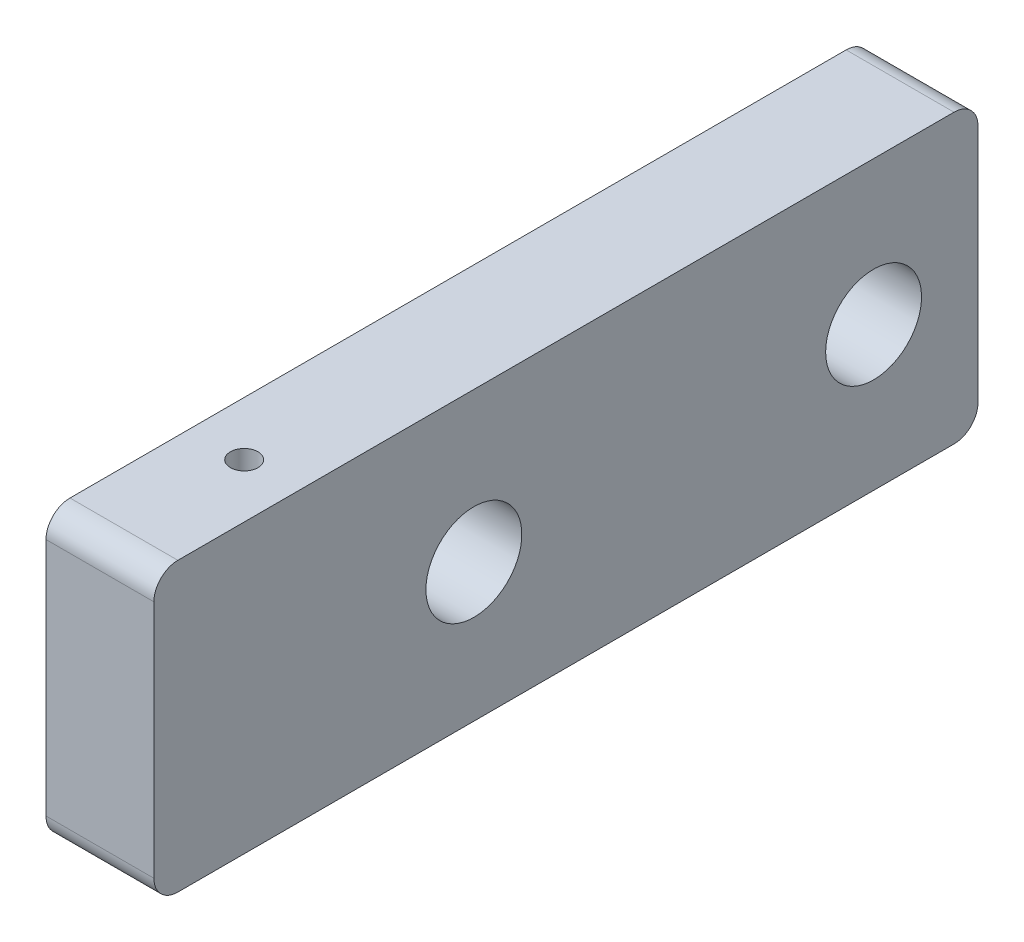
ISO-10303-21;
HEADER;
FILE_DESCRIPTION(('STEP AP214'),'2;1');
FILE_NAME('part.step','',(''),(''),'','','');
FILE_SCHEMA(('AUTOMOTIVE_DESIGN { 1 0 10303 214 1 1 1 1 }'));
ENDSEC;
DATA;
#1=APPLICATION_CONTEXT('core data for automotive mechanical design processes');
#2=APPLICATION_PROTOCOL_DEFINITION('international standard','automotive_design',2000,#1);
#3=PRODUCT_CONTEXT('',#1,'mechanical');
#4=PRODUCT('Part','Part','',(#3));
#5=PRODUCT_RELATED_PRODUCT_CATEGORY('part','',(#4));
#6=PRODUCT_DEFINITION_FORMATION('','',#4);
#7=PRODUCT_DEFINITION_CONTEXT('part definition',#1,'design');
#8=PRODUCT_DEFINITION('design','',#6,#7);
#9=PRODUCT_DEFINITION_SHAPE('','',#8);
#10=(LENGTH_UNIT() NAMED_UNIT(*) SI_UNIT(.MILLI.,.METRE.));
#11=(NAMED_UNIT(*) PLANE_ANGLE_UNIT() SI_UNIT($,.RADIAN.));
#12=(NAMED_UNIT(*) SI_UNIT($,.STERADIAN.) SOLID_ANGLE_UNIT());
#13=UNCERTAINTY_MEASURE_WITH_UNIT(LENGTH_MEASURE(1.E-05),#10,'distance_accuracy_value','');
#14=(GEOMETRIC_REPRESENTATION_CONTEXT(3) GLOBAL_UNCERTAINTY_ASSIGNED_CONTEXT((#13)) GLOBAL_UNIT_ASSIGNED_CONTEXT((#10,
#11,#12)) REPRESENTATION_CONTEXT('',''));
#15=CARTESIAN_POINT('',(0.,0.,0.));
#16=DIRECTION('',(0.,0.,1.));
#17=DIRECTION('',(1.,0.,0.));
#18=AXIS2_PLACEMENT_3D('',#15,#16,#17);
#19=CARTESIAN_POINT('',(65.9692086330936,-4.19999999999998,-14.0547659320805));
#20=DIRECTION('',(0.,0.,1.));
#21=DIRECTION('',(1.,0.,0.));
#22=AXIS2_PLACEMENT_3D('',#19,#20,#21);
#23=PLANE('',#22);
#24=DIRECTION('',(0.,-1.,0.));
#25=VECTOR('',#24,1.);
#26=CARTESIAN_POINT('',(74.9692086330936,-4.19999999999998,-14.0547659320805));
#27=LINE('',#26,#25);
#28=CARTESIAN_POINT('',(74.9692086330936,17.7712409049116,-14.0547659320805));
#29=VERTEX_POINT('',#28);
#30=CARTESIAN_POINT('',(74.9692086330936,-2.19999999999998,-14.0547659320805));
#31=VERTEX_POINT('',#30);
#32=EDGE_CURVE('E138',#29,#31,#27,.T.);
#33=ORIENTED_EDGE('',*,*,#32,.T.);
#34=DIRECTION('',(1.,0.,0.));
#35=VECTOR('',#34,1.);
#36=CARTESIAN_POINT('',(65.9692086330936,-2.19999999999998,-14.0547659320805));
#37=LINE('',#36,#35);
#38=CARTESIAN_POINT('',(65.9692086330936,-2.19999999999998,-14.0547659320805));
#39=VERTEX_POINT('',#38);
#40=EDGE_CURVE('E115',#31,#39,#37,.F.);
#41=ORIENTED_EDGE('',*,*,#40,.T.);
#42=DIRECTION('',(0.,-1.,0.));
#43=VECTOR('',#42,1.);
#44=CARTESIAN_POINT('',(65.9692086330936,-4.19999999999998,-14.0547659320805));
#45=LINE('',#44,#43);
#46=CARTESIAN_POINT('',(65.9692086330936,17.7712409049116,-14.0547659320805));
#47=VERTEX_POINT('',#46);
#48=EDGE_CURVE('E148',#47,#39,#45,.T.);
#49=ORIENTED_EDGE('',*,*,#48,.F.);
#50=DIRECTION('',(1.,0.,0.));
#51=VECTOR('',#50,1.);
#52=CARTESIAN_POINT('',(65.9692086330936,17.7712409049116,-14.0547659320805));
#53=LINE('',#52,#51);
#54=EDGE_CURVE('E120',#47,#29,#53,.T.);
#55=ORIENTED_EDGE('',*,*,#54,.T.);
#56=EDGE_LOOP('',(#33,#41,#49,#55));
#57=FACE_BOUND('',#56,.T.);
#58=ADVANCED_FACE('F44',(#57),#23,.F.);
#59=CARTESIAN_POINT('',(65.9692086330936,-4.19999999999998,54.6932024419858));
#60=DIRECTION('',(0.,1.,0.));
#61=DIRECTION('',(0.,0.,1.));
#62=AXIS2_PLACEMENT_3D('',#59,#60,#61);
#63=PLANE('',#62);
#64=DIRECTION('',(0.,0.,1.));
#65=VECTOR('',#64,1.);
#66=CARTESIAN_POINT('',(65.9692086330936,-4.19999999999998,54.6932024419858));
#67=LINE('',#66,#65);
#68=CARTESIAN_POINT('',(65.9692086330936,-4.19999999999998,-12.0547659320805));
#69=VERTEX_POINT('',#68);
#70=CARTESIAN_POINT('',(65.9692086330936,-4.19999999999998,52.6932024419858));
#71=VERTEX_POINT('',#70);
#72=EDGE_CURVE('E130',#69,#71,#67,.T.);
#73=ORIENTED_EDGE('',*,*,#72,.F.);
#74=DIRECTION('',(1.,0.,0.));
#75=VECTOR('',#74,1.);
#76=CARTESIAN_POINT('',(65.9692086330936,-4.19999999999998,-12.0547659320805));
#77=LINE('',#76,#75);
#78=CARTESIAN_POINT('',(74.9692086330936,-4.19999999999998,-12.0547659320805));
#79=VERTEX_POINT('',#78);
#80=EDGE_CURVE('E114',#69,#79,#77,.T.);
#81=ORIENTED_EDGE('',*,*,#80,.T.);
#82=DIRECTION('',(0.,0.,1.));
#83=VECTOR('',#82,1.);
#84=CARTESIAN_POINT('',(74.9692086330936,-4.19999999999998,54.6932024419858));
#85=LINE('',#84,#83);
#86=CARTESIAN_POINT('',(74.9692086330936,-4.19999999999998,52.6932024419858));
#87=VERTEX_POINT('',#86);
#88=EDGE_CURVE('E127',#79,#87,#85,.T.);
#89=ORIENTED_EDGE('',*,*,#88,.T.);
#90=DIRECTION('',(1.,0.,0.));
#91=VECTOR('',#90,1.);
#92=CARTESIAN_POINT('',(65.9692086330936,-4.19999999999998,52.6932024419858));
#93=LINE('',#92,#91);
#94=EDGE_CURVE('E132',#87,#71,#93,.F.);
#95=ORIENTED_EDGE('',*,*,#94,.T.);
#96=EDGE_LOOP('',(#73,#81,#89,#95));
#97=FACE_BOUND('',#96,.T.);
#98=ADVANCED_FACE('F126',(#97),#63,.F.);
#99=CARTESIAN_POINT('',(65.9692086330936,19.7712409049116,54.6932024419858));
#100=DIRECTION('',(0.,0.,-1.));
#101=DIRECTION('',(-1.,0.,0.));
#102=AXIS2_PLACEMENT_3D('',#99,#100,#101);
#103=PLANE('',#102);
#104=DIRECTION('',(0.,1.,0.));
#105=VECTOR('',#104,1.);
#106=CARTESIAN_POINT('',(74.9692086330936,19.7712409049116,54.6932024419858));
#107=LINE('',#106,#105);
#108=CARTESIAN_POINT('',(74.9692086330936,-2.19999999999998,54.6932024419858));
#109=VERTEX_POINT('',#108);
#110=CARTESIAN_POINT('',(74.9692086330936,17.7712409049116,54.6932024419858));
#111=VERTEX_POINT('',#110);
#112=EDGE_CURVE('E137',#109,#111,#107,.T.);
#113=ORIENTED_EDGE('',*,*,#112,.T.);
#114=DIRECTION('',(1.,0.,0.));
#115=VECTOR('',#114,1.);
#116=CARTESIAN_POINT('',(65.9692086330936,17.7712409049116,54.6932024419858));
#117=LINE('',#116,#115);
#118=CARTESIAN_POINT('',(65.9692086330936,17.7712409049116,54.6932024419858));
#119=VERTEX_POINT('',#118);
#120=EDGE_CURVE('E13',#111,#119,#117,.F.);
#121=ORIENTED_EDGE('',*,*,#120,.T.);
#122=DIRECTION('',(0.,1.,0.));
#123=VECTOR('',#122,1.);
#124=CARTESIAN_POINT('',(65.9692086330936,19.7712409049116,54.6932024419858));
#125=LINE('',#124,#123);
#126=CARTESIAN_POINT('',(65.9692086330936,-2.19999999999998,54.6932024419858));
#127=VERTEX_POINT('',#126);
#128=EDGE_CURVE('E173',#127,#119,#125,.T.);
#129=ORIENTED_EDGE('',*,*,#128,.F.);
#130=DIRECTION('',(1.,0.,0.));
#131=VECTOR('',#130,1.);
#132=CARTESIAN_POINT('',(65.9692086330936,-2.19999999999998,54.6932024419858));
#133=LINE('',#132,#131);
#134=EDGE_CURVE('E52',#127,#109,#133,.T.);
#135=ORIENTED_EDGE('',*,*,#134,.T.);
#136=EDGE_LOOP('',(#113,#121,#129,#135));
#137=FACE_BOUND('',#136,.T.);
#138=ADVANCED_FACE('F171',(#137),#103,.F.);
#139=CARTESIAN_POINT('',(65.9692086330936,19.7712409049116,54.6932024419858));
#140=DIRECTION('',(0.,-1.,0.));
#141=DIRECTION('',(0.,0.,-1.));
#142=AXIS2_PLACEMENT_3D('',#139,#140,#141);
#143=PLANE('',#142);
#144=CARTESIAN_POINT('',(70.4692086330936,19.7712409049116,42.6592779916703));
#145=DIRECTION('',(0.,1.,0.));
#146=DIRECTION('',(0.,0.,1.));
#147=AXIS2_PLACEMENT_3D('',#144,#145,#146);
#148=CIRCLE('',#147,1.15);
#149=CARTESIAN_POINT('',(70.4692086330936,19.7712409049116,43.8092779916703));
#150=VERTEX_POINT('',#149);
#151=EDGE_CURVE('E193',#150,#150,#148,.T.);
#152=ORIENTED_EDGE('',*,*,#151,.F.);
#153=EDGE_LOOP('',(#152));
#154=FACE_BOUND('',#153,.T.);
#155=DIRECTION('',(0.,0.,-1.));
#156=VECTOR('',#155,1.);
#157=CARTESIAN_POINT('',(65.9692086330936,19.7712409049116,54.6932024419858));
#158=LINE('',#157,#156);
#159=CARTESIAN_POINT('',(65.9692086330936,19.7712409049116,52.6932024419858));
#160=VERTEX_POINT('',#159);
#161=CARTESIAN_POINT('',(65.9692086330936,19.7712409049116,-12.0547659320805));
#162=VERTEX_POINT('',#161);
#163=EDGE_CURVE('E149',#160,#162,#158,.T.);
#164=ORIENTED_EDGE('',*,*,#163,.F.);
#165=DIRECTION('',(1.,0.,0.));
#166=VECTOR('',#165,1.);
#167=CARTESIAN_POINT('',(65.9692086330936,19.7712409049116,52.6932024419858));
#168=LINE('',#167,#166);
#169=CARTESIAN_POINT('',(74.9692086330936,19.7712409049116,52.6932024419858));
#170=VERTEX_POINT('',#169);
#171=EDGE_CURVE('E165',#160,#170,#168,.T.);
#172=ORIENTED_EDGE('',*,*,#171,.T.);
#173=DIRECTION('',(0.,0.,-1.));
#174=VECTOR('',#173,1.);
#175=CARTESIAN_POINT('',(74.9692086330936,19.7712409049116,54.6932024419858));
#176=LINE('',#175,#174);
#177=CARTESIAN_POINT('',(74.9692086330936,19.7712409049116,-12.0547659320805));
#178=VERTEX_POINT('',#177);
#179=EDGE_CURVE('E141',#170,#178,#176,.T.);
#180=ORIENTED_EDGE('',*,*,#179,.T.);
#181=DIRECTION('',(1.,0.,0.));
#182=VECTOR('',#181,1.);
#183=CARTESIAN_POINT('',(65.9692086330936,19.7712409049116,-12.0547659320805));
#184=LINE('',#183,#182);
#185=EDGE_CURVE('E59',#178,#162,#184,.F.);
#186=ORIENTED_EDGE('',*,*,#185,.T.);
#187=EDGE_LOOP('',(#164,#172,#180,#186));
#188=FACE_BOUND('',#187,.T.);
#189=ADVANCED_FACE('F180',(#154,#188),#143,.F.);
#190=CARTESIAN_POINT('',(65.9692086330936,0.,0.));
#191=DIRECTION('',(-1.,0.,0.));
#192=DIRECTION('',(0.,0.,1.));
#193=AXIS2_PLACEMENT_3D('',#190,#191,#192);
#194=PLANE('',#193);
#195=CARTESIAN_POINT('',(65.9692086330936,7.78562045245583,-5.34476642061127));
#196=DIRECTION('',(-1.,0.,0.));
#197=DIRECTION('',(0.,0.,1.));
#198=AXIS2_PLACEMENT_3D('',#195,#196,#197);
#199=CIRCLE('',#198,4.);
#200=CARTESIAN_POINT('',(65.9692086330936,7.78562045245583,-1.34476642061127));
#201=VERTEX_POINT('',#200);
#202=EDGE_CURVE('E201',#201,#201,#199,.T.);
#203=ORIENTED_EDGE('',*,*,#202,.F.);
#204=EDGE_LOOP('',(#203));
#205=FACE_BOUND('',#204,.T.);
#206=CARTESIAN_POINT('',(65.9692086330936,7.30000000000002,28.));
#207=DIRECTION('',(-1.,0.,0.));
#208=DIRECTION('',(0.,0.,1.));
#209=AXIS2_PLACEMENT_3D('',#206,#207,#208);
#210=CIRCLE('',#209,4.);
#211=CARTESIAN_POINT('',(65.9692086330936,7.30000000000002,32.));
#212=VERTEX_POINT('',#211);
#213=EDGE_CURVE('E187',#212,#212,#210,.T.);
#214=ORIENTED_EDGE('',*,*,#213,.F.);
#215=EDGE_LOOP('',(#214));
#216=FACE_BOUND('',#215,.T.);
#217=ORIENTED_EDGE('',*,*,#48,.T.);
#218=CARTESIAN_POINT('',(65.9692086330936,-2.19999999999998,-12.0547659320805));
#219=DIRECTION('',(-1.,0.,0.));
#220=DIRECTION('',(0.,0.,1.));
#221=AXIS2_PLACEMENT_3D('',#218,#219,#220);
#222=CIRCLE('',#221,2.);
#223=EDGE_CURVE('E162',#39,#69,#222,.T.);
#224=ORIENTED_EDGE('',*,*,#223,.T.);
#225=ORIENTED_EDGE('',*,*,#72,.T.);
#226=CARTESIAN_POINT('',(65.9692086330936,-2.19999999999998,52.6932024419858));
#227=DIRECTION('',(-1.,0.,0.));
#228=DIRECTION('',(0.,0.,1.));
#229=AXIS2_PLACEMENT_3D('',#226,#227,#228);
#230=CIRCLE('',#229,2.);
#231=EDGE_CURVE('E159',#71,#127,#230,.T.);
#232=ORIENTED_EDGE('',*,*,#231,.T.);
#233=ORIENTED_EDGE('',*,*,#128,.T.);
#234=CARTESIAN_POINT('',(65.9692086330936,17.7712409049116,52.6932024419858));
#235=DIRECTION('',(-1.,0.,0.));
#236=DIRECTION('',(0.,0.,1.));
#237=AXIS2_PLACEMENT_3D('',#234,#235,#236);
#238=CIRCLE('',#237,2.);
#239=EDGE_CURVE('E66',#119,#160,#238,.T.);
#240=ORIENTED_EDGE('',*,*,#239,.T.);
#241=ORIENTED_EDGE('',*,*,#163,.T.);
#242=CARTESIAN_POINT('',(65.9692086330936,17.7712409049116,-12.0547659320805));
#243=DIRECTION('',(-1.,0.,0.));
#244=DIRECTION('',(0.,0.,1.));
#245=AXIS2_PLACEMENT_3D('',#242,#243,#244);
#246=CIRCLE('',#245,2.);
#247=EDGE_CURVE('E157',#162,#47,#246,.T.);
#248=ORIENTED_EDGE('',*,*,#247,.T.);
#249=EDGE_LOOP('',(#217,#224,#225,#232,#233,#240,#241,#248));
#250=FACE_BOUND('',#249,.T.);
#251=ADVANCED_FACE('F208',(#205,#216,#250),#194,.T.);
#252=CARTESIAN_POINT('',(74.9692086330936,0.,0.));
#253=DIRECTION('',(-1.,0.,0.));
#254=DIRECTION('',(0.,0.,1.));
#255=AXIS2_PLACEMENT_3D('',#252,#253,#254);
#256=PLANE('',#255);
#257=CARTESIAN_POINT('',(74.9692086330936,7.78562045245583,-5.34476642061127));
#258=DIRECTION('',(-1.,0.,0.));
#259=DIRECTION('',(0.,0.,1.));
#260=AXIS2_PLACEMENT_3D('',#257,#258,#259);
#261=CIRCLE('',#260,4.);
#262=CARTESIAN_POINT('',(74.9692086330936,7.78562045245583,-1.34476642061127));
#263=VERTEX_POINT('',#262);
#264=EDGE_CURVE('E196',#263,#263,#261,.F.);
#265=ORIENTED_EDGE('',*,*,#264,.F.);
#266=EDGE_LOOP('',(#265));
#267=FACE_BOUND('',#266,.T.);
#268=CARTESIAN_POINT('',(74.9692086330936,7.30000000000002,28.));
#269=DIRECTION('',(-1.,0.,0.));
#270=DIRECTION('',(0.,0.,1.));
#271=AXIS2_PLACEMENT_3D('',#268,#269,#270);
#272=CIRCLE('',#271,4.);
#273=CARTESIAN_POINT('',(74.9692086330936,7.30000000000002,32.));
#274=VERTEX_POINT('',#273);
#275=EDGE_CURVE('E143',#274,#274,#272,.T.);
#276=ORIENTED_EDGE('',*,*,#275,.T.);
#277=EDGE_LOOP('',(#276));
#278=FACE_BOUND('',#277,.T.);
#279=ORIENTED_EDGE('',*,*,#88,.F.);
#280=CARTESIAN_POINT('',(74.9692086330936,-2.19999999999998,-12.0547659320805));
#281=DIRECTION('',(-1.,0.,0.));
#282=DIRECTION('',(0.,0.,1.));
#283=AXIS2_PLACEMENT_3D('',#280,#281,#282);
#284=CIRCLE('',#283,2.);
#285=EDGE_CURVE('E110',#79,#31,#284,.F.);
#286=ORIENTED_EDGE('',*,*,#285,.T.);
#287=ORIENTED_EDGE('',*,*,#32,.F.);
#288=CARTESIAN_POINT('',(74.9692086330936,17.7712409049116,-12.0547659320805));
#289=DIRECTION('',(-1.,0.,0.));
#290=DIRECTION('',(0.,0.,1.));
#291=AXIS2_PLACEMENT_3D('',#288,#289,#290);
#292=CIRCLE('',#291,2.);
#293=EDGE_CURVE('E131',#29,#178,#292,.F.);
#294=ORIENTED_EDGE('',*,*,#293,.T.);
#295=ORIENTED_EDGE('',*,*,#179,.F.);
#296=CARTESIAN_POINT('',(74.9692086330936,17.7712409049116,52.6932024419858));
#297=DIRECTION('',(-1.,0.,0.));
#298=DIRECTION('',(0.,0.,1.));
#299=AXIS2_PLACEMENT_3D('',#296,#297,#298);
#300=CIRCLE('',#299,2.);
#301=EDGE_CURVE('E121',#170,#111,#300,.F.);
#302=ORIENTED_EDGE('',*,*,#301,.T.);
#303=ORIENTED_EDGE('',*,*,#112,.F.);
#304=CARTESIAN_POINT('',(74.9692086330936,-2.19999999999998,52.6932024419858));
#305=DIRECTION('',(-1.,0.,0.));
#306=DIRECTION('',(0.,0.,1.));
#307=AXIS2_PLACEMENT_3D('',#304,#305,#306);
#308=CIRCLE('',#307,2.);
#309=EDGE_CURVE('E136',#109,#87,#308,.F.);
#310=ORIENTED_EDGE('',*,*,#309,.T.);
#311=EDGE_LOOP('',(#279,#286,#287,#294,#295,#302,#303,#310));
#312=FACE_BOUND('',#311,.T.);
#313=ADVANCED_FACE('F134',(#267,#278,#312),#256,.F.);
#314=CARTESIAN_POINT('',(74.9692086330936,7.30000000000002,28.));
#315=DIRECTION('',(-1.,0.,0.));
#316=DIRECTION('',(0.,0.,1.));
#317=AXIS2_PLACEMENT_3D('',#314,#315,#316);
#318=CYLINDRICAL_SURFACE('',#317,4.);
#319=ORIENTED_EDGE('',*,*,#275,.F.);
#320=EDGE_LOOP('',(#319));
#321=FACE_BOUND('',#320,.T.);
#322=ORIENTED_EDGE('',*,*,#213,.T.);
#323=EDGE_LOOP('',(#322));
#324=FACE_BOUND('',#323,.T.);
#325=ADVANCED_FACE('F237',(#321,#324),#318,.F.);
#326=CARTESIAN_POINT('',(65.9692086330936,-2.19999999999998,-12.0547659320805));
#327=DIRECTION('',(1.,0.,0.));
#328=DIRECTION('',(0.,0.,-1.));
#329=AXIS2_PLACEMENT_3D('',#326,#327,#328);
#330=CYLINDRICAL_SURFACE('',#329,2.);
#331=ORIENTED_EDGE('',*,*,#223,.F.);
#332=ORIENTED_EDGE('',*,*,#40,.F.);
#333=ORIENTED_EDGE('',*,*,#285,.F.);
#334=ORIENTED_EDGE('',*,*,#80,.F.);
#335=EDGE_LOOP('',(#331,#332,#333,#334));
#336=FACE_BOUND('',#335,.T.);
#337=ADVANCED_FACE('F113',(#336),#330,.T.);
#338=CARTESIAN_POINT('',(65.9692086330936,17.7712409049116,52.6932024419858));
#339=DIRECTION('',(1.,0.,0.));
#340=DIRECTION('',(0.,0.,-1.));
#341=AXIS2_PLACEMENT_3D('',#338,#339,#340);
#342=CYLINDRICAL_SURFACE('',#341,2.);
#343=ORIENTED_EDGE('',*,*,#239,.F.);
#344=ORIENTED_EDGE('',*,*,#120,.F.);
#345=ORIENTED_EDGE('',*,*,#301,.F.);
#346=ORIENTED_EDGE('',*,*,#171,.F.);
#347=EDGE_LOOP('',(#343,#344,#345,#346));
#348=FACE_BOUND('',#347,.T.);
#349=ADVANCED_FACE('F179',(#348),#342,.T.);
#350=CARTESIAN_POINT('',(65.9692086330936,-2.19999999999998,52.6932024419858));
#351=DIRECTION('',(1.,0.,0.));
#352=DIRECTION('',(0.,0.,-1.));
#353=AXIS2_PLACEMENT_3D('',#350,#351,#352);
#354=CYLINDRICAL_SURFACE('',#353,2.);
#355=ORIENTED_EDGE('',*,*,#231,.F.);
#356=ORIENTED_EDGE('',*,*,#94,.F.);
#357=ORIENTED_EDGE('',*,*,#309,.F.);
#358=ORIENTED_EDGE('',*,*,#134,.F.);
#359=EDGE_LOOP('',(#355,#356,#357,#358));
#360=FACE_BOUND('',#359,.T.);
#361=ADVANCED_FACE('F219',(#360),#354,.T.);
#362=CARTESIAN_POINT('',(65.9692086330936,17.7712409049116,-12.0547659320805));
#363=DIRECTION('',(1.,0.,0.));
#364=DIRECTION('',(0.,0.,-1.));
#365=AXIS2_PLACEMENT_3D('',#362,#363,#364);
#366=CYLINDRICAL_SURFACE('',#365,2.);
#367=ORIENTED_EDGE('',*,*,#247,.F.);
#368=ORIENTED_EDGE('',*,*,#185,.F.);
#369=ORIENTED_EDGE('',*,*,#293,.F.);
#370=ORIENTED_EDGE('',*,*,#54,.F.);
#371=EDGE_LOOP('',(#367,#368,#369,#370));
#372=FACE_BOUND('',#371,.T.);
#373=ADVANCED_FACE('F46',(#372),#366,.T.);
#374=CARTESIAN_POINT('',(70.4692086330936,14.7712409049116,42.6592779916703));
#375=DIRECTION('',(0.,1.,0.));
#376=DIRECTION('',(0.,0.,1.));
#377=AXIS2_PLACEMENT_3D('',#374,#375,#376);
#378=CYLINDRICAL_SURFACE('',#377,1.15);
#379=CARTESIAN_POINT('',(70.4692086330936,14.7712409049116,42.6592779916703));
#380=DIRECTION('',(0.,1.,0.));
#381=DIRECTION('',(0.,0.,1.));
#382=AXIS2_PLACEMENT_3D('',#379,#380,#381);
#383=CIRCLE('',#382,1.15);
#384=CARTESIAN_POINT('',(70.4692086330936,14.7712409049116,43.8092779916703));
#385=VERTEX_POINT('',#384);
#386=EDGE_CURVE('E190',#385,#385,#383,.T.);
#387=ORIENTED_EDGE('',*,*,#386,.F.);
#388=EDGE_LOOP('',(#387));
#389=FACE_BOUND('',#388,.T.);
#390=ORIENTED_EDGE('',*,*,#151,.T.);
#391=EDGE_LOOP('',(#390));
#392=FACE_BOUND('',#391,.T.);
#393=ADVANCED_FACE('F218',(#389,#392),#378,.F.);
#394=CARTESIAN_POINT('',(70.4692086330936,14.7712409049116,42.6592779916703));
#395=DIRECTION('',(0.,1.,0.));
#396=DIRECTION('',(0.,0.,1.));
#397=AXIS2_PLACEMENT_3D('',#394,#395,#396);
#398=PLANE('',#397);
#399=ORIENTED_EDGE('',*,*,#386,.T.);
#400=EDGE_LOOP('',(#399));
#401=FACE_BOUND('',#400,.T.);
#402=ADVANCED_FACE('F224',(#401),#398,.T.);
#403=CARTESIAN_POINT('',(74.9702086330936,7.78562045245583,-5.34476642061127));
#404=DIRECTION('',(-1.,0.,0.));
#405=DIRECTION('',(0.,0.,1.));
#406=AXIS2_PLACEMENT_3D('',#403,#404,#405);
#407=CYLINDRICAL_SURFACE('',#406,4.);
#408=ORIENTED_EDGE('',*,*,#202,.T.);
#409=EDGE_LOOP('',(#408));
#410=FACE_BOUND('',#409,.T.);
#411=ORIENTED_EDGE('',*,*,#264,.T.);
#412=EDGE_LOOP('',(#411));
#413=FACE_BOUND('',#412,.T.);
#414=ADVANCED_FACE('F205',(#410,#413),#407,.F.);
#415=CLOSED_SHELL('',(#58,#98,#138,#189,#251,#313,#325,#337,#349,#361,#373,#393,#402,#414));
#416=MANIFOLD_SOLID_BREP('B2',#415);
#417=ADVANCED_BREP_SHAPE_REPRESENTATION('',(#18,#416),#14);
#418=SHAPE_DEFINITION_REPRESENTATION(#9,#417);
ENDSEC;
END-ISO-10303-21;
